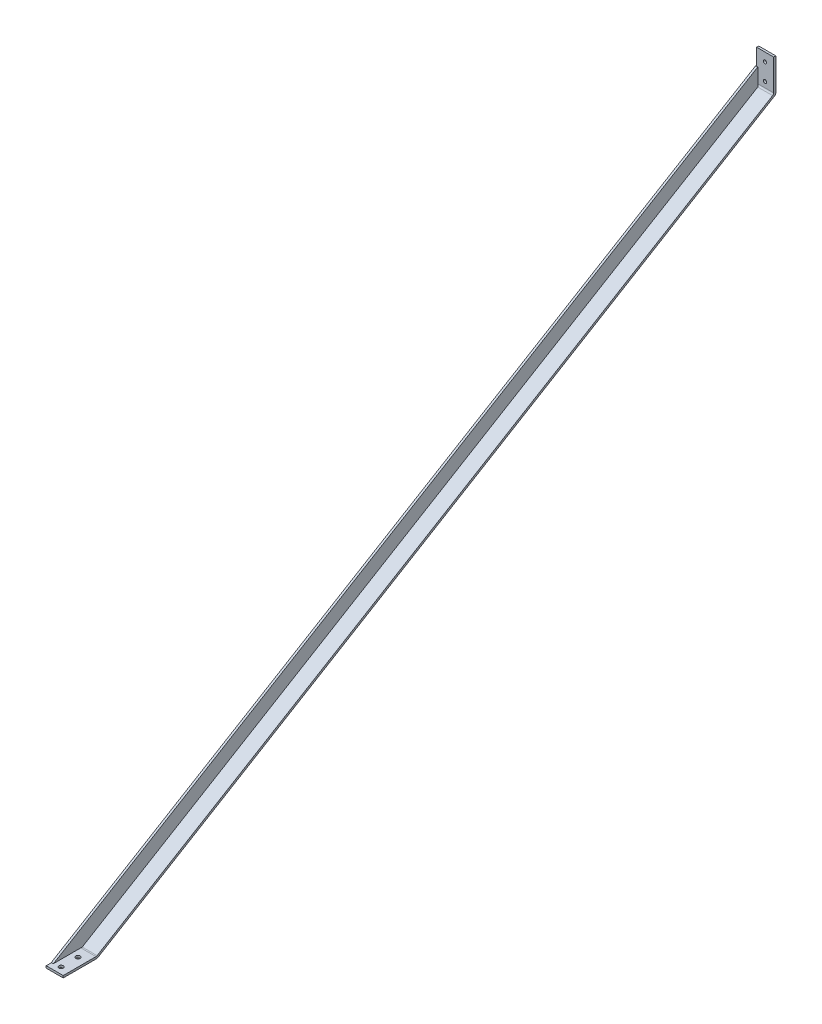
ISO-10303-21;
HEADER;
FILE_DESCRIPTION(('STEP AP214'),'2;1');
FILE_NAME('part.step','',(''),(''),'','','');
FILE_SCHEMA(('AUTOMOTIVE_DESIGN { 1 0 10303 214 1 1 1 1 }'));
ENDSEC;
DATA;
#1=APPLICATION_CONTEXT('core data for automotive mechanical design processes');
#2=APPLICATION_PROTOCOL_DEFINITION('international standard','automotive_design',2000,#1);
#3=PRODUCT_CONTEXT('',#1,'mechanical');
#4=PRODUCT('Part','Part','',(#3));
#5=PRODUCT_RELATED_PRODUCT_CATEGORY('part','',(#4));
#6=PRODUCT_DEFINITION_FORMATION('','',#4);
#7=PRODUCT_DEFINITION_CONTEXT('part definition',#1,'design');
#8=PRODUCT_DEFINITION('design','',#6,#7);
#9=PRODUCT_DEFINITION_SHAPE('','',#8);
#10=(LENGTH_UNIT() NAMED_UNIT(*) SI_UNIT(.MILLI.,.METRE.));
#11=(NAMED_UNIT(*) PLANE_ANGLE_UNIT() SI_UNIT($,.RADIAN.));
#12=(NAMED_UNIT(*) SI_UNIT($,.STERADIAN.) SOLID_ANGLE_UNIT());
#13=UNCERTAINTY_MEASURE_WITH_UNIT(LENGTH_MEASURE(1.E-05),#10,'distance_accuracy_value','');
#14=(GEOMETRIC_REPRESENTATION_CONTEXT(3) GLOBAL_UNCERTAINTY_ASSIGNED_CONTEXT((#13)) GLOBAL_UNIT_ASSIGNED_CONTEXT((#10,
#11,#12)) REPRESENTATION_CONTEXT('',''));
#15=CARTESIAN_POINT('',(0.,0.,0.));
#16=DIRECTION('',(0.,0.,1.));
#17=DIRECTION('',(1.,0.,0.));
#18=AXIS2_PLACEMENT_3D('',#15,#16,#17);
#19=CARTESIAN_POINT('',(12.3585074316,648.462,1.5875));
#20=DIRECTION('',(0.,0.,1.));
#21=DIRECTION('',(1.,0.,0.));
#22=AXIS2_PLACEMENT_3D('',#19,#20,#21);
#23=CYLINDRICAL_SURFACE('',#22,2.4892);
#24=CARTESIAN_POINT('',(12.3585074316,648.462,3.175));
#25=DIRECTION('',(0.,0.,1.));
#26=DIRECTION('',(1.,0.,0.));
#27=AXIS2_PLACEMENT_3D('',#24,#25,#26);
#28=CIRCLE('',#27,2.4892);
#29=CARTESIAN_POINT('',(14.8477074316,648.462,3.175));
#30=VERTEX_POINT('',#29);
#31=EDGE_CURVE('E255',#30,#30,#28,.F.);
#32=ORIENTED_EDGE('',*,*,#31,.F.);
#33=EDGE_LOOP('',(#32));
#34=FACE_BOUND('',#33,.T.);
#35=CARTESIAN_POINT('',(12.3585074316,648.462,0.));
#36=DIRECTION('',(0.,0.,1.));
#37=DIRECTION('',(1.,0.,0.));
#38=AXIS2_PLACEMENT_3D('',#35,#36,#37);
#39=CIRCLE('',#38,2.4892);
#40=CARTESIAN_POINT('',(14.8477074316,648.462,0.));
#41=VERTEX_POINT('',#40);
#42=EDGE_CURVE('E261',#41,#41,#39,.T.);
#43=ORIENTED_EDGE('',*,*,#42,.F.);
#44=EDGE_LOOP('',(#43));
#45=FACE_BOUND('',#44,.T.);
#46=ADVANCED_FACE('F17',(#34,#45),#23,.F.);
#47=CARTESIAN_POINT('',(12.3585074316,623.062,1.5875));
#48=DIRECTION('',(0.,0.,1.));
#49=DIRECTION('',(1.,0.,0.));
#50=AXIS2_PLACEMENT_3D('',#47,#48,#49);
#51=CYLINDRICAL_SURFACE('',#50,2.4892);
#52=CARTESIAN_POINT('',(12.3585074316,623.062,3.175));
#53=DIRECTION('',(0.,0.,1.));
#54=DIRECTION('',(1.,0.,0.));
#55=AXIS2_PLACEMENT_3D('',#52,#53,#54);
#56=CIRCLE('',#55,2.4892);
#57=CARTESIAN_POINT('',(14.8477074316,623.062,3.175));
#58=VERTEX_POINT('',#57);
#59=EDGE_CURVE('E252',#58,#58,#56,.F.);
#60=ORIENTED_EDGE('',*,*,#59,.F.);
#61=EDGE_LOOP('',(#60));
#62=FACE_BOUND('',#61,.T.);
#63=CARTESIAN_POINT('',(12.3585074316,623.062,0.));
#64=DIRECTION('',(0.,0.,1.));
#65=DIRECTION('',(1.,0.,0.));
#66=AXIS2_PLACEMENT_3D('',#63,#64,#65);
#67=CIRCLE('',#66,2.4892);
#68=CARTESIAN_POINT('',(14.8477074316,623.062,0.));
#69=VERTEX_POINT('',#68);
#70=EDGE_CURVE('E258',#69,#69,#67,.T.);
#71=ORIENTED_EDGE('',*,*,#70,.F.);
#72=EDGE_LOOP('',(#71));
#73=FACE_BOUND('',#72,.T.);
#74=ADVANCED_FACE('F382',(#62,#73),#51,.F.);
#75=CARTESIAN_POINT('',(0.,612.917723323,3.175));
#76=DIRECTION('',(0.,0.856526135374868,0.516103651817921));
#77=DIRECTION('',(0.,-0.516103651817921,0.856526135374868));
#78=AXIS2_PLACEMENT_3D('',#75,#76,#77);
#79=PLANE('',#78);
#80=DIRECTION('',(1.,0.,0.));
#81=VECTOR('',#80,1.);
#82=CARTESIAN_POINT('',(12.7,611.991976165135,4.7113709055612));
#83=LINE('',#82,#81);
#84=CARTESIAN_POINT('',(25.4,611.991976165093,4.71137090547728));
#85=VERTEX_POINT('',#84);
#86=CARTESIAN_POINT('',(3.175,611.991976165034,4.7113709055003));
#87=VERTEX_POINT('',#86);
#88=EDGE_CURVE('E208',#85,#87,#83,.F.);
#89=ORIENTED_EDGE('',*,*,#88,.T.);
#90=DIRECTION('',(0.,0.516103651819046,-0.85652613537419));
#91=VECTOR('',#90,1.);
#92=CARTESIAN_POINT('',(3.175,3.63052952019,1014.3486346));
#93=LINE('',#92,#91);
#94=CARTESIAN_POINT('',(3.175,3.63052952079444,1014.34863460036));
#95=VERTEX_POINT('',#94);
#96=EDGE_CURVE('E195',#95,#87,#93,.T.);
#97=ORIENTED_EDGE('',*,*,#96,.F.);
#98=DIRECTION('',(1.,0.,0.));
#99=VECTOR('',#98,1.);
#100=CARTESIAN_POINT('',(12.7,3.63052952260789,1014.34863460146));
#101=LINE('',#100,#99);
#102=CARTESIAN_POINT('',(25.4,3.63052952018853,1014.34863460274));
#103=VERTEX_POINT('',#102);
#104=EDGE_CURVE('E186',#95,#103,#101,.T.);
#105=ORIENTED_EDGE('',*,*,#104,.T.);
#106=DIRECTION('',(0.,-0.516103651819046,0.85652613537419));
#107=VECTOR('',#106,1.);
#108=CARTESIAN_POINT('',(25.4,611.991976165,4.71137090548));
#109=LINE('',#108,#107);
#110=EDGE_CURVE('E175',#85,#103,#109,.T.);
#111=ORIENTED_EDGE('',*,*,#110,.F.);
#112=EDGE_LOOP('',(#89,#97,#105,#111));
#113=FACE_BOUND('',#112,.T.);
#114=ADVANCED_FACE('F362',(#113),#79,.T.);
#115=CARTESIAN_POINT('',(3.175,0.,0.));
#116=DIRECTION('',(1.,0.,0.));
#117=DIRECTION('',(0.,0.,-1.));
#118=AXIS2_PLACEMENT_3D('',#115,#116,#117);
#119=PLANE('',#118);
#120=DIRECTION('',(0.,0.,1.));
#121=VECTOR('',#120,1.);
#122=CARTESIAN_POINT('',(3.175,3.63052952019,1008.19676959));
#123=LINE('',#122,#121);
#124=CARTESIAN_POINT('',(3.175,3.63052952019,1057.41168971));
#125=VERTEX_POINT('',#124);
#126=EDGE_CURVE('E190',#125,#95,#123,.F.);
#127=ORIENTED_EDGE('',*,*,#126,.T.);
#128=ORIENTED_EDGE('',*,*,#96,.T.);
#129=DIRECTION('',(0.,1.,0.));
#130=VECTOR('',#129,1.);
#131=CARTESIAN_POINT('',(3.175,637.939812527,4.71137090548));
#132=LINE('',#131,#130);
#133=CARTESIAN_POINT('',(3.175,637.939812525865,4.71137090502438));
#134=VERTEX_POINT('',#133);
#135=EDGE_CURVE('E205',#87,#134,#132,.T.);
#136=ORIENTED_EDGE('',*,*,#135,.T.);
#137=DIRECTION('',(0.,0.516103651817921,-0.856526135374868));
#138=VECTOR('',#137,1.);
#139=CARTESIAN_POINT('',(3.175,3.63052952019,1057.41168971));
#140=LINE('',#139,#138);
#141=EDGE_CURVE('E199',#134,#125,#140,.F.);
#142=ORIENTED_EDGE('',*,*,#141,.T.);
#143=EDGE_LOOP('',(#127,#128,#136,#142));
#144=FACE_BOUND('',#143,.T.);
#145=ADVANCED_FACE('F373',(#144),#119,.T.);
#146=CARTESIAN_POINT('',(12.7,6.35,1015.9872637));
#147=DIRECTION('',(1.,0.,0.));
#148=DIRECTION('',(0.,0.,-1.));
#149=AXIS2_PLACEMENT_3D('',#146,#147,#148);
#150=CYLINDRICAL_SURFACE('',#149,3.175);
#151=CARTESIAN_POINT('',(25.4,6.35,1015.9872637));
#152=DIRECTION('',(1.,0.,0.));
#153=DIRECTION('',(0.,0.,-1.));
#154=AXIS2_PLACEMENT_3D('',#151,#152,#153);
#155=CIRCLE('',#154,3.175);
#156=CARTESIAN_POINT('',(25.4,3.175,1015.9872637));
#157=VERTEX_POINT('',#156);
#158=EDGE_CURVE('E178',#103,#157,#155,.F.);
#159=ORIENTED_EDGE('',*,*,#158,.F.);
#160=ORIENTED_EDGE('',*,*,#104,.F.);
#161=DIRECTION('',(1.,0.,0.));
#162=VECTOR('',#161,1.);
#163=CARTESIAN_POINT('',(0.,3.63052952019,1014.3486346));
#164=LINE('',#163,#162);
#165=CARTESIAN_POINT('',(0.,3.63052952019,1014.34863460273));
#166=VERTEX_POINT('',#165);
#167=EDGE_CURVE('E183',#95,#166,#164,.F.);
#168=ORIENTED_EDGE('',*,*,#167,.T.);
#169=CARTESIAN_POINT('',(0.,6.35,1015.9872637));
#170=DIRECTION('',(1.,0.,0.));
#171=DIRECTION('',(0.,0.,-1.));
#172=AXIS2_PLACEMENT_3D('',#169,#170,#171);
#173=CIRCLE('',#172,3.175);
#174=CARTESIAN_POINT('',(0.,3.175,1015.9872637));
#175=VERTEX_POINT('',#174);
#176=EDGE_CURVE('E20',#175,#166,#173,.T.);
#177=ORIENTED_EDGE('',*,*,#176,.F.);
#178=DIRECTION('',(1.,0.,0.));
#179=VECTOR('',#178,1.);
#180=CARTESIAN_POINT('',(0.,3.175,1015.9872637));
#181=LINE('',#180,#179);
#182=EDGE_CURVE('E182',#157,#175,#181,.F.);
#183=ORIENTED_EDGE('',*,*,#182,.F.);
#184=EDGE_LOOP('',(#159,#160,#168,#177,#183));
#185=FACE_BOUND('',#184,.T.);
#186=ADVANCED_FACE('F272',(#185),#150,.F.);
#187=CARTESIAN_POINT('',(25.4,0.,0.));
#188=DIRECTION('',(1.,0.,0.));
#189=DIRECTION('',(0.,0.,-1.));
#190=AXIS2_PLACEMENT_3D('',#187,#188,#189);
#191=PLANE('',#190);
#192=CARTESIAN_POINT('',(25.4,614.711446645,6.35));
#193=DIRECTION('',(1.,0.,0.));
#194=DIRECTION('',(0.,0.,-1.));
#195=AXIS2_PLACEMENT_3D('',#192,#193,#194);
#196=CIRCLE('',#195,3.175);
#197=CARTESIAN_POINT('',(25.4,614.711446645,3.175));
#198=VERTEX_POINT('',#197);
#199=EDGE_CURVE('E213',#198,#85,#196,.F.);
#200=ORIENTED_EDGE('',*,*,#199,.T.);
#201=ORIENTED_EDGE('',*,*,#110,.T.);
#202=ORIENTED_EDGE('',*,*,#158,.T.);
#203=DIRECTION('',(0.,0.,1.));
#204=VECTOR('',#203,1.);
#205=CARTESIAN_POINT('',(25.4,3.175,1015.10463185));
#206=LINE('',#205,#204);
#207=CARTESIAN_POINT('',(25.4,3.175,1065.022));
#208=VERTEX_POINT('',#207);
#209=EDGE_CURVE('E179',#208,#157,#206,.F.);
#210=ORIENTED_EDGE('',*,*,#209,.F.);
#211=DIRECTION('',(0.,1.,0.));
#212=VECTOR('',#211,1.);
#213=CARTESIAN_POINT('',(25.4,3.175,1065.022));
#214=LINE('',#213,#212);
#215=CARTESIAN_POINT('',(25.4,0.,1065.022));
#216=VERTEX_POINT('',#215);
#217=EDGE_CURVE('E167',#216,#208,#214,.T.);
#218=ORIENTED_EDGE('',*,*,#217,.F.);
#219=DIRECTION('',(0.,0.,-1.));
#220=VECTOR('',#219,1.);
#221=CARTESIAN_POINT('',(25.4,0.,1065.022));
#222=LINE('',#221,#220);
#223=CARTESIAN_POINT('',(25.4,0.,1015.10463185));
#224=VERTEX_POINT('',#223);
#225=EDGE_CURVE('E163',#224,#216,#222,.F.);
#226=ORIENTED_EDGE('',*,*,#225,.F.);
#227=CARTESIAN_POINT('',(25.4,3.175,1015.10463185));
#228=DIRECTION('',(1.,0.,0.));
#229=DIRECTION('',(0.,0.,-1.));
#230=AXIS2_PLACEMENT_3D('',#227,#228,#229);
#231=CIRCLE('',#230,3.175);
#232=CARTESIAN_POINT('',(25.4,0.455529520700888,1013.46600275305));
#233=VERTEX_POINT('',#232);
#234=EDGE_CURVE('E149',#233,#224,#231,.F.);
#235=ORIENTED_EDGE('',*,*,#234,.F.);
#236=DIRECTION('',(0.,0.516103651817921,-0.856526135374868));
#237=VECTOR('',#236,1.);
#238=CARTESIAN_POINT('',(25.4,-2.27373675443E-13,1014.222));
#239=LINE('',#238,#237);
#240=CARTESIAN_POINT('',(25.4,610.198252842706,1.53637090524638));
#241=VERTEX_POINT('',#240);
#242=EDGE_CURVE('E145',#241,#233,#239,.F.);
#243=ORIENTED_EDGE('',*,*,#242,.F.);
#244=CARTESIAN_POINT('',(25.4,612.917723323,3.175));
#245=DIRECTION('',(1.,0.,0.));
#246=DIRECTION('',(0.,0.,-1.));
#247=AXIS2_PLACEMENT_3D('',#244,#245,#246);
#248=CIRCLE('',#247,3.175);
#249=CARTESIAN_POINT('',(25.4,612.917723323,0.));
#250=VERTEX_POINT('',#249);
#251=EDGE_CURVE('E133',#250,#241,#248,.F.);
#252=ORIENTED_EDGE('',*,*,#251,.F.);
#253=DIRECTION('',(0.,1.,0.));
#254=VECTOR('',#253,1.);
#255=CARTESIAN_POINT('',(25.4,611.124,0.));
#256=LINE('',#255,#254);
#257=CARTESIAN_POINT('',(25.4,661.162,0.));
#258=VERTEX_POINT('',#257);
#259=EDGE_CURVE('E128',#258,#250,#256,.F.);
#260=ORIENTED_EDGE('',*,*,#259,.F.);
#261=DIRECTION('',(0.,0.,1.));
#262=VECTOR('',#261,1.);
#263=CARTESIAN_POINT('',(25.4,661.162,0.));
#264=LINE('',#263,#262);
#265=CARTESIAN_POINT('',(25.4,661.162,3.175));
#266=VERTEX_POINT('',#265);
#267=EDGE_CURVE('E219',#266,#258,#264,.F.);
#268=ORIENTED_EDGE('',*,*,#267,.F.);
#269=DIRECTION('',(0.,1.,0.));
#270=VECTOR('',#269,1.);
#271=CARTESIAN_POINT('',(25.4,661.162,3.175));
#272=LINE('',#271,#270);
#273=EDGE_CURVE('E216',#198,#266,#272,.T.);
#274=ORIENTED_EDGE('',*,*,#273,.F.);
#275=EDGE_LOOP('',(#200,#201,#202,#210,#218,#226,#235,#243,#252,#260,#268,#274));
#276=FACE_BOUND('',#275,.T.);
#277=ADVANCED_FACE('F147',(#276),#191,.T.);
#278=CARTESIAN_POINT('',(12.7,3.175,1015.10463185));
#279=DIRECTION('',(1.,0.,0.));
#280=DIRECTION('',(0.,0.,-1.));
#281=AXIS2_PLACEMENT_3D('',#278,#279,#280);
#282=CYLINDRICAL_SURFACE('',#281,3.175);
#283=CARTESIAN_POINT('',(0.,3.175,1015.10463185));
#284=DIRECTION('',(1.,0.,0.));
#285=DIRECTION('',(0.,0.,-1.));
#286=AXIS2_PLACEMENT_3D('',#283,#284,#285);
#287=CIRCLE('',#286,3.175);
#288=CARTESIAN_POINT('',(0.,0.,1015.10463185));
#289=VERTEX_POINT('',#288);
#290=CARTESIAN_POINT('',(0.,0.455529519839954,1013.46600275253));
#291=VERTEX_POINT('',#290);
#292=EDGE_CURVE('E35',#289,#291,#287,.T.);
#293=ORIENTED_EDGE('',*,*,#292,.T.);
#294=DIRECTION('',(1.,0.,0.));
#295=VECTOR('',#294,1.);
#296=CARTESIAN_POINT('',(0.,0.455529521911868,1013.46600275104));
#297=LINE('',#296,#295);
#298=EDGE_CURVE('E142',#233,#291,#297,.F.);
#299=ORIENTED_EDGE('',*,*,#298,.F.);
#300=ORIENTED_EDGE('',*,*,#234,.T.);
#301=DIRECTION('',(1.,0.,0.));
#302=VECTOR('',#301,1.);
#303=CARTESIAN_POINT('',(0.,0.,1015.10463185));
#304=LINE('',#303,#302);
#305=EDGE_CURVE('E243',#289,#224,#304,.T.);
#306=ORIENTED_EDGE('',*,*,#305,.F.);
#307=EDGE_LOOP('',(#293,#299,#300,#306));
#308=FACE_BOUND('',#307,.T.);
#309=ADVANCED_FACE('F425',(#308),#282,.T.);
#310=CARTESIAN_POINT('',(12.7,0.927499996647,1055.497));
#311=DIRECTION('',(0.,1.,0.));
#312=DIRECTION('',(0.,0.,1.));
#313=AXIS2_PLACEMENT_3D('',#310,#311,#312);
#314=CYLINDRICAL_SURFACE('',#313,3.2639);
#315=CARTESIAN_POINT('',(12.7,3.175,1055.497));
#316=DIRECTION('',(0.,1.,0.));
#317=DIRECTION('',(0.,0.,1.));
#318=AXIS2_PLACEMENT_3D('',#315,#316,#317);
#319=CIRCLE('',#318,3.2639);
#320=CARTESIAN_POINT('',(12.7,3.175,1058.7609));
#321=VERTEX_POINT('',#320);
#322=EDGE_CURVE('E247',#321,#321,#319,.F.);
#323=ORIENTED_EDGE('',*,*,#322,.F.);
#324=EDGE_LOOP('',(#323));
#325=FACE_BOUND('',#324,.T.);
#326=CARTESIAN_POINT('',(12.7,0.,1055.497));
#327=DIRECTION('',(0.,1.,0.));
#328=DIRECTION('',(0.,0.,1.));
#329=AXIS2_PLACEMENT_3D('',#326,#327,#328);
#330=CIRCLE('',#329,3.2639);
#331=CARTESIAN_POINT('',(12.7,0.,1058.7609));
#332=VERTEX_POINT('',#331);
#333=EDGE_CURVE('E240',#332,#332,#330,.T.);
#334=ORIENTED_EDGE('',*,*,#333,.F.);
#335=EDGE_LOOP('',(#334));
#336=FACE_BOUND('',#335,.T.);
#337=ADVANCED_FACE('F421',(#325,#336),#314,.F.);
#338=CARTESIAN_POINT('',(12.7,0.927499996647,1030.097));
#339=DIRECTION('',(0.,1.,0.));
#340=DIRECTION('',(0.,0.,1.));
#341=AXIS2_PLACEMENT_3D('',#338,#339,#340);
#342=CYLINDRICAL_SURFACE('',#341,3.2639);
#343=CARTESIAN_POINT('',(12.7,3.175,1030.097));
#344=DIRECTION('',(0.,1.,0.));
#345=DIRECTION('',(0.,0.,1.));
#346=AXIS2_PLACEMENT_3D('',#343,#344,#345);
#347=CIRCLE('',#346,3.2639);
#348=CARTESIAN_POINT('',(12.7,3.175,1033.3609));
#349=VERTEX_POINT('',#348);
#350=EDGE_CURVE('E244',#349,#349,#347,.F.);
#351=ORIENTED_EDGE('',*,*,#350,.F.);
#352=EDGE_LOOP('',(#351));
#353=FACE_BOUND('',#352,.T.);
#354=CARTESIAN_POINT('',(12.7,0.,1030.097));
#355=DIRECTION('',(0.,1.,0.));
#356=DIRECTION('',(0.,0.,1.));
#357=AXIS2_PLACEMENT_3D('',#354,#355,#356);
#358=CIRCLE('',#357,3.2639);
#359=CARTESIAN_POINT('',(12.7,0.,1033.3609));
#360=VERTEX_POINT('',#359);
#361=EDGE_CURVE('E237',#360,#360,#358,.T.);
#362=ORIENTED_EDGE('',*,*,#361,.F.);
#363=EDGE_LOOP('',(#362));
#364=FACE_BOUND('',#363,.T.);
#365=ADVANCED_FACE('F418',(#353,#364),#342,.F.);
#366=CARTESIAN_POINT('',(0.,-2.27373675443E-13,1014.222));
#367=DIRECTION('',(0.,-0.856526135374868,-0.516103651817921));
#368=DIRECTION('',(0.,0.516103651817921,-0.856526135374868));
#369=AXIS2_PLACEMENT_3D('',#366,#367,#368);
#370=PLANE('',#369);
#371=ORIENTED_EDGE('',*,*,#242,.T.);
#372=ORIENTED_EDGE('',*,*,#298,.T.);
#373=DIRECTION('',(0.,0.516103651820035,-0.856526135373594));
#374=VECTOR('',#373,1.);
#375=CARTESIAN_POINT('',(0.,0.455529520186,1013.46600275));
#376=LINE('',#375,#374);
#377=CARTESIAN_POINT('',(0.,610.198252843094,1.53637090547572));
#378=VERTEX_POINT('',#377);
#379=EDGE_CURVE('E156',#291,#378,#376,.T.);
#380=ORIENTED_EDGE('',*,*,#379,.T.);
#381=DIRECTION('',(1.,0.,0.));
#382=VECTOR('',#381,1.);
#383=CARTESIAN_POINT('',(12.7,610.198252843135,1.5363709055612));
#384=LINE('',#383,#382);
#385=EDGE_CURVE('E138',#241,#378,#384,.F.);
#386=ORIENTED_EDGE('',*,*,#385,.F.);
#387=EDGE_LOOP('',(#371,#372,#380,#386));
#388=FACE_BOUND('',#387,.T.);
#389=ADVANCED_FACE('F155',(#388),#370,.T.);
#390=CARTESIAN_POINT('',(12.7,612.917723323,3.175));
#391=DIRECTION('',(1.,0.,0.));
#392=DIRECTION('',(0.,0.,-1.));
#393=AXIS2_PLACEMENT_3D('',#390,#391,#392);
#394=CYLINDRICAL_SURFACE('',#393,3.175);
#395=CARTESIAN_POINT('',(0.,612.917723323,3.175));
#396=DIRECTION('',(1.,0.,0.));
#397=DIRECTION('',(0.,0.,-1.));
#398=AXIS2_PLACEMENT_3D('',#395,#396,#397);
#399=CIRCLE('',#398,3.175);
#400=CARTESIAN_POINT('',(0.,612.917723323,0.));
#401=VERTEX_POINT('',#400);
#402=EDGE_CURVE('E234',#378,#401,#399,.T.);
#403=ORIENTED_EDGE('',*,*,#402,.T.);
#404=DIRECTION('',(-1.,0.,0.));
#405=VECTOR('',#404,1.);
#406=CARTESIAN_POINT('',(0.,612.917723323,0.));
#407=LINE('',#406,#405);
#408=EDGE_CURVE('E140',#250,#401,#407,.T.);
#409=ORIENTED_EDGE('',*,*,#408,.F.);
#410=ORIENTED_EDGE('',*,*,#251,.T.);
#411=ORIENTED_EDGE('',*,*,#385,.T.);
#412=EDGE_LOOP('',(#403,#409,#410,#411));
#413=FACE_BOUND('',#412,.T.);
#414=ADVANCED_FACE('F136',(#413),#394,.T.);
#415=CARTESIAN_POINT('',(0.,611.124,0.));
#416=DIRECTION('',(0.,0.,-1.));
#417=DIRECTION('',(-1.,0.,0.));
#418=AXIS2_PLACEMENT_3D('',#415,#416,#417);
#419=PLANE('',#418);
#420=ORIENTED_EDGE('',*,*,#70,.T.);
#421=EDGE_LOOP('',(#420));
#422=FACE_BOUND('',#421,.T.);
#423=ORIENTED_EDGE('',*,*,#42,.T.);
#424=EDGE_LOOP('',(#423));
#425=FACE_BOUND('',#424,.T.);
#426=ORIENTED_EDGE('',*,*,#259,.T.);
#427=ORIENTED_EDGE('',*,*,#408,.T.);
#428=DIRECTION('',(0.,1.,0.));
#429=VECTOR('',#428,1.);
#430=CARTESIAN_POINT('',(0.,0.,0.));
#431=LINE('',#430,#429);
#432=CARTESIAN_POINT('',(0.,661.162,0.));
#433=VERTEX_POINT('',#432);
#434=EDGE_CURVE('E236',#401,#433,#431,.T.);
#435=ORIENTED_EDGE('',*,*,#434,.T.);
#436=DIRECTION('',(1.,0.,0.));
#437=VECTOR('',#436,1.);
#438=CARTESIAN_POINT('',(0.,661.162,0.));
#439=LINE('',#438,#437);
#440=EDGE_CURVE('E224',#258,#433,#439,.F.);
#441=ORIENTED_EDGE('',*,*,#440,.F.);
#442=EDGE_LOOP('',(#426,#427,#435,#441));
#443=FACE_BOUND('',#442,.T.);
#444=ADVANCED_FACE('F320',(#422,#425,#443),#419,.T.);
#445=CARTESIAN_POINT('',(0.,661.162,0.));
#446=DIRECTION('',(0.,1.,0.));
#447=DIRECTION('',(0.,0.,1.));
#448=AXIS2_PLACEMENT_3D('',#445,#446,#447);
#449=PLANE('',#448);
#450=DIRECTION('',(1.,0.,0.));
#451=VECTOR('',#450,1.);
#452=CARTESIAN_POINT('',(0.,661.162,3.175));
#453=LINE('',#452,#451);
#454=CARTESIAN_POINT('',(0.,661.162,3.175));
#455=VERTEX_POINT('',#454);
#456=EDGE_CURVE('E218',#266,#455,#453,.F.);
#457=ORIENTED_EDGE('',*,*,#456,.F.);
#458=ORIENTED_EDGE('',*,*,#267,.T.);
#459=ORIENTED_EDGE('',*,*,#440,.T.);
#460=DIRECTION('',(0.,0.,-1.));
#461=VECTOR('',#460,1.);
#462=CARTESIAN_POINT('',(0.,661.162,0.));
#463=LINE('',#462,#461);
#464=EDGE_CURVE('E303',#433,#455,#463,.F.);
#465=ORIENTED_EDGE('',*,*,#464,.T.);
#466=EDGE_LOOP('',(#457,#458,#459,#465));
#467=FACE_BOUND('',#466,.T.);
#468=ADVANCED_FACE('F312',(#467),#449,.T.);
#469=CARTESIAN_POINT('',(0.,661.162,3.175));
#470=DIRECTION('',(0.,0.,1.));
#471=DIRECTION('',(1.,0.,0.));
#472=AXIS2_PLACEMENT_3D('',#469,#470,#471);
#473=PLANE('',#472);
#474=ORIENTED_EDGE('',*,*,#59,.T.);
#475=EDGE_LOOP('',(#474));
#476=FACE_BOUND('',#475,.T.);
#477=ORIENTED_EDGE('',*,*,#31,.T.);
#478=EDGE_LOOP('',(#477));
#479=FACE_BOUND('',#478,.T.);
#480=DIRECTION('',(0.,1.,0.));
#481=VECTOR('',#480,1.);
#482=CARTESIAN_POINT('',(0.,0.,3.175));
#483=LINE('',#482,#481);
#484=CARTESIAN_POINT('',(0.,614.711446645,3.175));
#485=VERTEX_POINT('',#484);
#486=EDGE_CURVE('E233',#455,#485,#483,.F.);
#487=ORIENTED_EDGE('',*,*,#486,.T.);
#488=DIRECTION('',(1.,0.,0.));
#489=VECTOR('',#488,1.);
#490=CARTESIAN_POINT('',(12.7,614.711446645,3.175));
#491=LINE('',#490,#489);
#492=EDGE_CURVE('E251',#485,#198,#491,.T.);
#493=ORIENTED_EDGE('',*,*,#492,.T.);
#494=ORIENTED_EDGE('',*,*,#273,.T.);
#495=ORIENTED_EDGE('',*,*,#456,.T.);
#496=EDGE_LOOP('',(#487,#493,#494,#495));
#497=FACE_BOUND('',#496,.T.);
#498=ADVANCED_FACE('F355',(#476,#479,#497),#473,.T.);
#499=CARTESIAN_POINT('',(12.7,614.711446645,6.35));
#500=DIRECTION('',(1.,0.,0.));
#501=DIRECTION('',(0.,0.,-1.));
#502=AXIS2_PLACEMENT_3D('',#499,#500,#501);
#503=CYLINDRICAL_SURFACE('',#502,3.175);
#504=ORIENTED_EDGE('',*,*,#88,.F.);
#505=ORIENTED_EDGE('',*,*,#199,.F.);
#506=ORIENTED_EDGE('',*,*,#492,.F.);
#507=CARTESIAN_POINT('',(0.,614.711446645,6.35));
#508=DIRECTION('',(1.,0.,0.));
#509=DIRECTION('',(0.,0.,-1.));
#510=AXIS2_PLACEMENT_3D('',#507,#508,#509);
#511=CIRCLE('',#510,3.175);
#512=CARTESIAN_POINT('',(0.,611.991976165092,4.71137090548));
#513=VERTEX_POINT('',#512);
#514=EDGE_CURVE('E229',#485,#513,#511,.F.);
#515=ORIENTED_EDGE('',*,*,#514,.T.);
#516=DIRECTION('',(1.,0.,0.));
#517=VECTOR('',#516,1.);
#518=CARTESIAN_POINT('',(0.,611.991976165,4.71137090548));
#519=LINE('',#518,#517);
#520=EDGE_CURVE('E202',#513,#87,#519,.T.);
#521=ORIENTED_EDGE('',*,*,#520,.T.);
#522=EDGE_LOOP('',(#504,#505,#506,#515,#521));
#523=FACE_BOUND('',#522,.T.);
#524=ADVANCED_FACE('F359',(#523),#503,.F.);
#525=CARTESIAN_POINT('',(0.,637.939812527,4.71137090548));
#526=DIRECTION('',(0.,0.,1.));
#527=DIRECTION('',(1.,0.,0.));
#528=AXIS2_PLACEMENT_3D('',#525,#526,#527);
#529=PLANE('',#528);
#530=DIRECTION('',(0.,1.,0.));
#531=VECTOR('',#530,1.);
#532=CARTESIAN_POINT('',(0.,0.,4.71137090548));
#533=LINE('',#532,#531);
#534=CARTESIAN_POINT('',(0.,637.939812526622,4.71137090525219));
#535=VERTEX_POINT('',#534);
#536=EDGE_CURVE('E232',#513,#535,#533,.T.);
#537=ORIENTED_EDGE('',*,*,#536,.T.);
#538=DIRECTION('',(1.,0.,0.));
#539=VECTOR('',#538,1.);
#540=CARTESIAN_POINT('',(0.,637.939812525865,4.71137090479656));
#541=LINE('',#540,#539);
#542=EDGE_CURVE('E201',#535,#134,#541,.T.);
#543=ORIENTED_EDGE('',*,*,#542,.T.);
#544=ORIENTED_EDGE('',*,*,#135,.F.);
#545=ORIENTED_EDGE('',*,*,#520,.F.);
#546=EDGE_LOOP('',(#537,#543,#544,#545));
#547=FACE_BOUND('',#546,.T.);
#548=ADVANCED_FACE('F371',(#547),#529,.F.);
#549=CARTESIAN_POINT('',(0.,3.63052952019,1057.41168971));
#550=DIRECTION('',(0.,-0.856526135374868,-0.516103651817921));
#551=DIRECTION('',(0.,0.516103651817921,-0.856526135374868));
#552=AXIS2_PLACEMENT_3D('',#549,#550,#551);
#553=PLANE('',#552);
#554=DIRECTION('',(0.,-0.516103651818843,0.856526135374312));
#555=VECTOR('',#554,1.);
#556=CARTESIAN_POINT('',(0.,637.939812527,4.71137090548));
#557=LINE('',#556,#555);
#558=CARTESIAN_POINT('',(0.,3.63052952019008,1057.41168971));
#559=VERTEX_POINT('',#558);
#560=EDGE_CURVE('E284',#535,#559,#557,.T.);
#561=ORIENTED_EDGE('',*,*,#560,.T.);
#562=DIRECTION('',(1.,0.,0.));
#563=VECTOR('',#562,1.);
#564=CARTESIAN_POINT('',(0.,3.63052952019,1057.41168971));
#565=LINE('',#564,#563);
#566=EDGE_CURVE('E80',#559,#125,#565,.T.);
#567=ORIENTED_EDGE('',*,*,#566,.T.);
#568=ORIENTED_EDGE('',*,*,#141,.F.);
#569=ORIENTED_EDGE('',*,*,#542,.F.);
#570=EDGE_LOOP('',(#561,#567,#568,#569));
#571=FACE_BOUND('',#570,.T.);
#572=ADVANCED_FACE('F368',(#571),#553,.F.);
#573=CARTESIAN_POINT('',(0.,3.63052952019,1008.19676959));
#574=DIRECTION('',(0.,1.,0.));
#575=DIRECTION('',(0.,0.,1.));
#576=AXIS2_PLACEMENT_3D('',#573,#574,#575);
#577=PLANE('',#576);
#578=ORIENTED_EDGE('',*,*,#126,.F.);
#579=ORIENTED_EDGE('',*,*,#566,.F.);
#580=DIRECTION('',(0.,0.,-1.));
#581=VECTOR('',#580,1.);
#582=CARTESIAN_POINT('',(0.,3.63052952019,0.));
#583=LINE('',#582,#581);
#584=EDGE_CURVE('E287',#559,#166,#583,.T.);
#585=ORIENTED_EDGE('',*,*,#584,.T.);
#586=ORIENTED_EDGE('',*,*,#167,.F.);
#587=EDGE_LOOP('',(#578,#579,#585,#586));
#588=FACE_BOUND('',#587,.T.);
#589=ADVANCED_FACE('F364',(#588),#577,.F.);
#590=CARTESIAN_POINT('',(0.,3.175,1015.10463185));
#591=DIRECTION('',(0.,1.,0.));
#592=DIRECTION('',(0.,0.,1.));
#593=AXIS2_PLACEMENT_3D('',#590,#591,#592);
#594=PLANE('',#593);
#595=ORIENTED_EDGE('',*,*,#350,.T.);
#596=EDGE_LOOP('',(#595));
#597=FACE_BOUND('',#596,.T.);
#598=ORIENTED_EDGE('',*,*,#322,.T.);
#599=EDGE_LOOP('',(#598));
#600=FACE_BOUND('',#599,.T.);
#601=ORIENTED_EDGE('',*,*,#209,.T.);
#602=ORIENTED_EDGE('',*,*,#182,.T.);
#603=DIRECTION('',(0.,0.,-1.));
#604=VECTOR('',#603,1.);
#605=CARTESIAN_POINT('',(0.,3.175,0.));
#606=LINE('',#605,#604);
#607=CARTESIAN_POINT('',(0.,3.175,1065.022));
#608=VERTEX_POINT('',#607);
#609=EDGE_CURVE('E336',#175,#608,#606,.F.);
#610=ORIENTED_EDGE('',*,*,#609,.T.);
#611=DIRECTION('',(1.,0.,0.));
#612=VECTOR('',#611,1.);
#613=CARTESIAN_POINT('',(0.,3.175,1065.022));
#614=LINE('',#613,#612);
#615=EDGE_CURVE('E172',#208,#608,#614,.F.);
#616=ORIENTED_EDGE('',*,*,#615,.F.);
#617=EDGE_LOOP('',(#601,#602,#610,#616));
#618=FACE_BOUND('',#617,.T.);
#619=ADVANCED_FACE('F270',(#597,#600,#618),#594,.T.);
#620=CARTESIAN_POINT('',(0.,3.175,1065.022));
#621=DIRECTION('',(0.,0.,1.));
#622=DIRECTION('',(1.,0.,0.));
#623=AXIS2_PLACEMENT_3D('',#620,#621,#622);
#624=PLANE('',#623);
#625=DIRECTION('',(1.,0.,0.));
#626=VECTOR('',#625,1.);
#627=CARTESIAN_POINT('',(0.,0.,1065.022));
#628=LINE('',#627,#626);
#629=CARTESIAN_POINT('',(0.,0.,1065.022));
#630=VERTEX_POINT('',#629);
#631=EDGE_CURVE('E166',#216,#630,#628,.F.);
#632=ORIENTED_EDGE('',*,*,#631,.F.);
#633=ORIENTED_EDGE('',*,*,#217,.T.);
#634=ORIENTED_EDGE('',*,*,#615,.T.);
#635=DIRECTION('',(0.,1.,0.));
#636=VECTOR('',#635,1.);
#637=CARTESIAN_POINT('',(0.,0.,1065.022));
#638=LINE('',#637,#636);
#639=EDGE_CURVE('E26',#608,#630,#638,.F.);
#640=ORIENTED_EDGE('',*,*,#639,.T.);
#641=EDGE_LOOP('',(#632,#633,#634,#640));
#642=FACE_BOUND('',#641,.T.);
#643=ADVANCED_FACE('F341',(#642),#624,.T.);
#644=CARTESIAN_POINT('',(0.,0.,1065.022));
#645=DIRECTION('',(0.,-1.,0.));
#646=DIRECTION('',(0.,0.,-1.));
#647=AXIS2_PLACEMENT_3D('',#644,#645,#646);
#648=PLANE('',#647);
#649=ORIENTED_EDGE('',*,*,#361,.T.);
#650=EDGE_LOOP('',(#649));
#651=FACE_BOUND('',#650,.T.);
#652=ORIENTED_EDGE('',*,*,#333,.T.);
#653=EDGE_LOOP('',(#652));
#654=FACE_BOUND('',#653,.T.);
#655=DIRECTION('',(0.,0.,-1.));
#656=VECTOR('',#655,1.);
#657=CARTESIAN_POINT('',(0.,0.,0.));
#658=LINE('',#657,#656);
#659=EDGE_CURVE('E11',#630,#289,#658,.T.);
#660=ORIENTED_EDGE('',*,*,#659,.T.);
#661=ORIENTED_EDGE('',*,*,#305,.T.);
#662=ORIENTED_EDGE('',*,*,#225,.T.);
#663=ORIENTED_EDGE('',*,*,#631,.T.);
#664=EDGE_LOOP('',(#660,#661,#662,#663));
#665=FACE_BOUND('',#664,.T.);
#666=ADVANCED_FACE('F385',(#651,#654,#665),#648,.T.);
#667=CARTESIAN_POINT('',(0.,0.,0.));
#668=DIRECTION('',(1.,0.,0.));
#669=DIRECTION('',(0.,0.,-1.));
#670=AXIS2_PLACEMENT_3D('',#667,#668,#669);
#671=PLANE('',#670);
#672=ORIENTED_EDGE('',*,*,#659,.F.);
#673=ORIENTED_EDGE('',*,*,#639,.F.);
#674=ORIENTED_EDGE('',*,*,#609,.F.);
#675=ORIENTED_EDGE('',*,*,#176,.T.);
#676=ORIENTED_EDGE('',*,*,#584,.F.);
#677=ORIENTED_EDGE('',*,*,#560,.F.);
#678=ORIENTED_EDGE('',*,*,#536,.F.);
#679=ORIENTED_EDGE('',*,*,#514,.F.);
#680=ORIENTED_EDGE('',*,*,#486,.F.);
#681=ORIENTED_EDGE('',*,*,#464,.F.);
#682=ORIENTED_EDGE('',*,*,#434,.F.);
#683=ORIENTED_EDGE('',*,*,#402,.F.);
#684=ORIENTED_EDGE('',*,*,#379,.F.);
#685=ORIENTED_EDGE('',*,*,#292,.F.);
#686=EDGE_LOOP('',(#672,#673,#674,#675,#676,#677,#678,#679,#680,#681,#682,#683,#684,#685));
#687=FACE_BOUND('',#686,.T.);
#688=ADVANCED_FACE('F317',(#687),#671,.F.);
#689=CLOSED_SHELL('',(#46,#74,#114,#145,#186,#277,#309,#337,#365,#389,#414,#444,#468,#498,#524,
#548,#572,#589,#619,#643,#666,#688));
#690=MANIFOLD_SOLID_BREP('B1',#689);
#691=ADVANCED_BREP_SHAPE_REPRESENTATION('',(#18,#690),#14);
#692=SHAPE_DEFINITION_REPRESENTATION(#9,#691);
ENDSEC;
END-ISO-10303-21;
